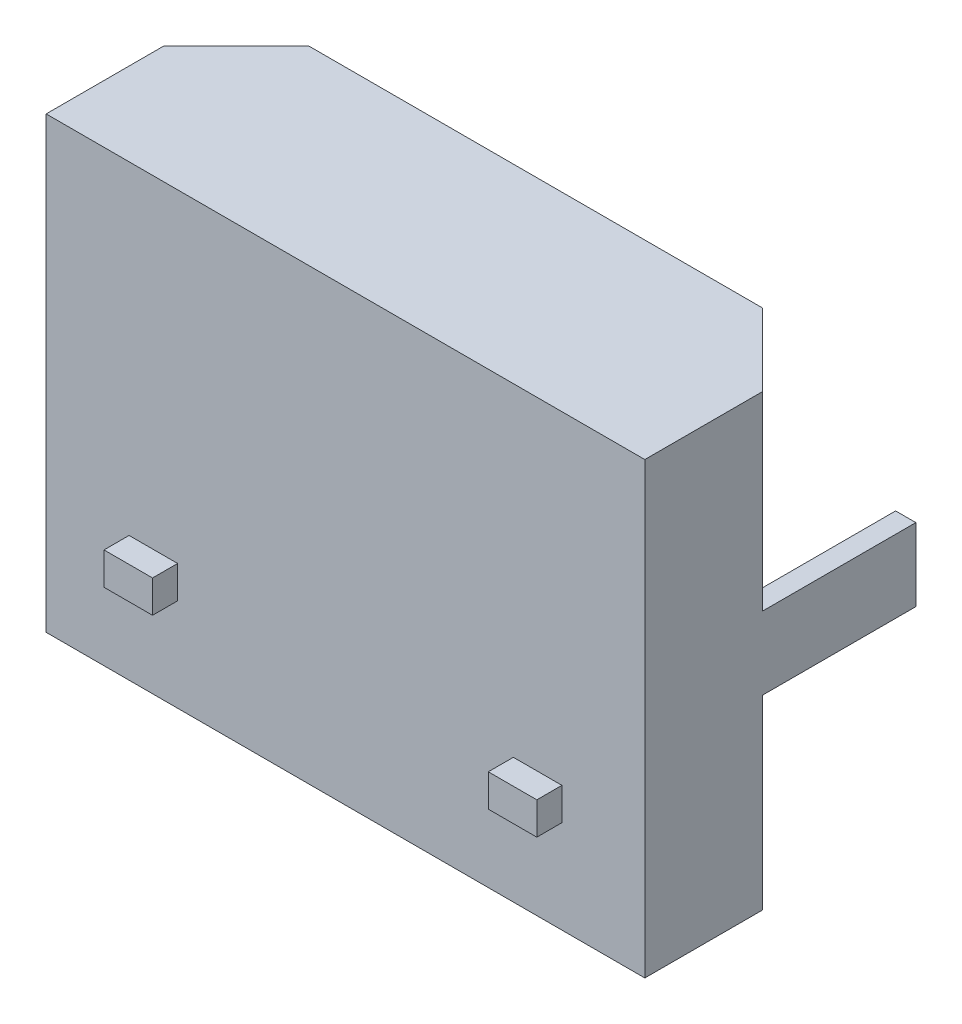
ISO-10303-21;
HEADER;
FILE_DESCRIPTION(('STEP AP214'),'2;1');
FILE_NAME('part.step','',(''),(''),'','','');
FILE_SCHEMA(('AUTOMOTIVE_DESIGN { 1 0 10303 214 1 1 1 1 }'));
ENDSEC;
DATA;
#1=APPLICATION_CONTEXT('core data for automotive mechanical design processes');
#2=APPLICATION_PROTOCOL_DEFINITION('international standard','automotive_design',2000,#1);
#3=PRODUCT_CONTEXT('',#1,'mechanical');
#4=PRODUCT('Part','Part','',(#3));
#5=PRODUCT_RELATED_PRODUCT_CATEGORY('part','',(#4));
#6=PRODUCT_DEFINITION_FORMATION('','',#4);
#7=PRODUCT_DEFINITION_CONTEXT('part definition',#1,'design');
#8=PRODUCT_DEFINITION('design','',#6,#7);
#9=PRODUCT_DEFINITION_SHAPE('','',#8);
#10=(LENGTH_UNIT() NAMED_UNIT(*) SI_UNIT(.MILLI.,.METRE.));
#11=(NAMED_UNIT(*) PLANE_ANGLE_UNIT() SI_UNIT($,.RADIAN.));
#12=(NAMED_UNIT(*) SI_UNIT($,.STERADIAN.) SOLID_ANGLE_UNIT());
#13=UNCERTAINTY_MEASURE_WITH_UNIT(LENGTH_MEASURE(1.E-05),#10,'distance_accuracy_value','');
#14=(GEOMETRIC_REPRESENTATION_CONTEXT(3) GLOBAL_UNCERTAINTY_ASSIGNED_CONTEXT((#13)) GLOBAL_UNIT_ASSIGNED_CONTEXT((#10,
#11,#12)) REPRESENTATION_CONTEXT('',''));
#15=CARTESIAN_POINT('',(0.,0.,0.));
#16=DIRECTION('',(0.,0.,1.));
#17=DIRECTION('',(1.,0.,0.));
#18=AXIS2_PLACEMENT_3D('',#15,#16,#17);
#19=CARTESIAN_POINT('',(0.,2.79999999999999,2.35000000000001));
#20=DIRECTION('',(0.,0.,1.));
#21=DIRECTION('',(-1.,0.,0.));
#22=AXIS2_PLACEMENT_3D('',#19,#20,#21);
#23=PLANE('',#22);
#24=DIRECTION('',(1.,0.,0.));
#25=VECTOR('',#24,1.);
#26=CARTESIAN_POINT('',(-2.675,-1.60000000000001,2.34999999999999));
#27=LINE('',#26,#25);
#28=CARTESIAN_POINT('',(-2.675,-1.60000000000001,2.34999999999999));
#29=VERTEX_POINT('',#28);
#30=CARTESIAN_POINT('',(-2.075,-1.60000000000001,2.34999999999999));
#31=VERTEX_POINT('',#30);
#32=EDGE_CURVE('E248',#29,#31,#27,.T.);
#33=ORIENTED_EDGE('',*,*,#32,.F.);
#34=DIRECTION('',(0.,-1.,0.));
#35=VECTOR('',#34,1.);
#36=CARTESIAN_POINT('',(-2.675,-1.60000000000001,2.34999999999999));
#37=LINE('',#36,#35);
#38=CARTESIAN_POINT('',(-2.675,-1.20000000000001,2.35));
#39=VERTEX_POINT('',#38);
#40=EDGE_CURVE('E245',#39,#29,#37,.T.);
#41=ORIENTED_EDGE('',*,*,#40,.F.);
#42=DIRECTION('',(-1.,0.,0.));
#43=VECTOR('',#42,1.);
#44=CARTESIAN_POINT('',(-2.675,-1.20000000000001,2.35));
#45=LINE('',#44,#43);
#46=CARTESIAN_POINT('',(-2.075,-1.20000000000001,2.35));
#47=VERTEX_POINT('',#46);
#48=EDGE_CURVE('E257',#47,#39,#45,.T.);
#49=ORIENTED_EDGE('',*,*,#48,.F.);
#50=DIRECTION('',(0.,1.,0.));
#51=VECTOR('',#50,1.);
#52=CARTESIAN_POINT('',(-2.075,-1.60000000000001,2.34999999999999));
#53=LINE('',#52,#51);
#54=EDGE_CURVE('E265',#31,#47,#53,.T.);
#55=ORIENTED_EDGE('',*,*,#54,.F.);
#56=EDGE_LOOP('',(#33,#41,#49,#55));
#57=FACE_BOUND('',#56,.T.);
#58=DIRECTION('',(0.,-1.,0.));
#59=VECTOR('',#58,1.);
#60=CARTESIAN_POINT('',(-3.7,2.79999999999999,2.35000000000001));
#61=LINE('',#60,#59);
#62=CARTESIAN_POINT('',(-3.7,2.79999999999999,2.35000000000001));
#63=VERTEX_POINT('',#62);
#64=CARTESIAN_POINT('',(-3.7,-2.75000000000001,2.34999999999999));
#65=VERTEX_POINT('',#64);
#66=EDGE_CURVE('E423',#63,#65,#61,.T.);
#67=ORIENTED_EDGE('',*,*,#66,.T.);
#68=DIRECTION('',(-1.,0.,0.));
#69=VECTOR('',#68,1.);
#70=CARTESIAN_POINT('',(0.,-2.75000000000001,2.34999999999999));
#71=LINE('',#70,#69);
#72=CARTESIAN_POINT('',(3.7,-2.75000000000001,2.34999999999999));
#73=VERTEX_POINT('',#72);
#74=EDGE_CURVE('E388',#73,#65,#71,.T.);
#75=ORIENTED_EDGE('',*,*,#74,.F.);
#76=DIRECTION('',(0.,-1.,0.));
#77=VECTOR('',#76,1.);
#78=CARTESIAN_POINT('',(3.7,2.79999999999999,2.35000000000001));
#79=LINE('',#78,#77);
#80=CARTESIAN_POINT('',(3.7,2.79999999999999,2.35000000000001));
#81=VERTEX_POINT('',#80);
#82=EDGE_CURVE('E425',#81,#73,#79,.T.);
#83=ORIENTED_EDGE('',*,*,#82,.F.);
#84=DIRECTION('',(-1.,0.,0.));
#85=VECTOR('',#84,1.);
#86=CARTESIAN_POINT('',(0.,2.79999999999999,2.35000000000001));
#87=LINE('',#86,#85);
#88=EDGE_CURVE('E406',#81,#63,#87,.T.);
#89=ORIENTED_EDGE('',*,*,#88,.T.);
#90=EDGE_LOOP('',(#67,#75,#83,#89));
#91=FACE_BOUND('',#90,.T.);
#92=DIRECTION('',(1.,0.,0.));
#93=VECTOR('',#92,1.);
#94=CARTESIAN_POINT('',(2.075,-1.60000000000001,2.35));
#95=LINE('',#94,#93);
#96=CARTESIAN_POINT('',(2.075,-1.60000000000001,2.35));
#97=VERTEX_POINT('',#96);
#98=CARTESIAN_POINT('',(2.675,-1.60000000000001,2.35));
#99=VERTEX_POINT('',#98);
#100=EDGE_CURVE('E784',#97,#99,#95,.T.);
#101=ORIENTED_EDGE('',*,*,#100,.F.);
#102=DIRECTION('',(0.,-1.,0.));
#103=VECTOR('',#102,1.);
#104=CARTESIAN_POINT('',(2.075,-1.60000000000001,2.35));
#105=LINE('',#104,#103);
#106=CARTESIAN_POINT('',(2.075,-1.20000000000001,2.35));
#107=VERTEX_POINT('',#106);
#108=EDGE_CURVE('E243',#107,#97,#105,.T.);
#109=ORIENTED_EDGE('',*,*,#108,.F.);
#110=DIRECTION('',(-1.,0.,0.));
#111=VECTOR('',#110,1.);
#112=CARTESIAN_POINT('',(2.075,-1.20000000000001,2.35));
#113=LINE('',#112,#111);
#114=CARTESIAN_POINT('',(2.675,-1.20000000000001,2.35));
#115=VERTEX_POINT('',#114);
#116=EDGE_CURVE('E239',#115,#107,#113,.T.);
#117=ORIENTED_EDGE('',*,*,#116,.F.);
#118=DIRECTION('',(0.,1.,0.));
#119=VECTOR('',#118,1.);
#120=CARTESIAN_POINT('',(2.675,-1.60000000000001,2.35));
#121=LINE('',#120,#119);
#122=EDGE_CURVE('E781',#99,#115,#121,.T.);
#123=ORIENTED_EDGE('',*,*,#122,.F.);
#124=EDGE_LOOP('',(#101,#109,#117,#123));
#125=FACE_BOUND('',#124,.T.);
#126=ADVANCED_FACE('F34',(#57,#91,#125),#23,.T.);
#127=CARTESIAN_POINT('',(0.,2.8,0.));
#128=DIRECTION('',(0.,0.,-1.));
#129=DIRECTION('',(1.,0.,0.));
#130=AXIS2_PLACEMENT_3D('',#127,#128,#129);
#131=PLANE('',#130);
#132=DIRECTION('',(0.,-1.,0.));
#133=VECTOR('',#132,1.);
#134=CARTESIAN_POINT('',(2.80355339059327,2.8,0.));
#135=LINE('',#134,#133);
#136=CARTESIAN_POINT('',(2.80355339059327,2.8,0.));
#137=VERTEX_POINT('',#136);
#138=CARTESIAN_POINT('',(2.80355339059327,-2.75,0.));
#139=VERTEX_POINT('',#138);
#140=EDGE_CURVE('E415',#137,#139,#135,.T.);
#141=ORIENTED_EDGE('',*,*,#140,.T.);
#142=DIRECTION('',(1.,0.,0.));
#143=VECTOR('',#142,1.);
#144=CARTESIAN_POINT('',(0.,-2.75,0.));
#145=LINE('',#144,#143);
#146=CARTESIAN_POINT('',(-2.80355339059327,-2.75,0.));
#147=VERTEX_POINT('',#146);
#148=EDGE_CURVE('E371',#147,#139,#145,.T.);
#149=ORIENTED_EDGE('',*,*,#148,.F.);
#150=DIRECTION('',(0.,-1.,0.));
#151=VECTOR('',#150,1.);
#152=CARTESIAN_POINT('',(-2.80355339059327,2.8,0.));
#153=LINE('',#152,#151);
#154=CARTESIAN_POINT('',(-2.80355339059327,2.8,0.));
#155=VERTEX_POINT('',#154);
#156=EDGE_CURVE('E416',#155,#147,#153,.T.);
#157=ORIENTED_EDGE('',*,*,#156,.F.);
#158=DIRECTION('',(1.,0.,0.));
#159=VECTOR('',#158,1.);
#160=CARTESIAN_POINT('',(0.,2.8,0.));
#161=LINE('',#160,#159);
#162=EDGE_CURVE('E397',#155,#137,#161,.T.);
#163=ORIENTED_EDGE('',*,*,#162,.T.);
#164=EDGE_LOOP('',(#141,#149,#157,#163));
#165=FACE_BOUND('',#164,.T.);
#166=ADVANCED_FACE('F36',(#165),#131,.T.);
#167=CARTESIAN_POINT('',(-1.40177669529664,2.8,-1.40177669529663));
#168=DIRECTION('',(-0.707106781186548,0.,-0.707106781186547));
#169=DIRECTION('',(0.707106781186547,0.,-0.707106781186548));
#170=AXIS2_PLACEMENT_3D('',#167,#168,#169);
#171=PLANE('',#170);
#172=DIRECTION('',(0.707106781186547,0.,-0.707106781186548));
#173=VECTOR('',#172,1.);
#174=CARTESIAN_POINT('',(-1.40177669529664,0.450000000000005,-1.40177669529664));
#175=LINE('',#174,#173);
#176=CARTESIAN_POINT('',(-3.7,0.449999999999997,0.896446609406729));
#177=VERTEX_POINT('',#176);
#178=CARTESIAN_POINT('',(-3.45,0.449999999999998,0.646446609406728));
#179=VERTEX_POINT('',#178);
#180=EDGE_CURVE('E352',#177,#179,#175,.T.);
#181=ORIENTED_EDGE('',*,*,#180,.F.);
#182=DIRECTION('',(0.,-1.,0.));
#183=VECTOR('',#182,1.);
#184=CARTESIAN_POINT('',(-3.7,2.8,0.896446609406737));
#185=LINE('',#184,#183);
#186=CARTESIAN_POINT('',(-3.7,2.8,0.896446609406737));
#187=VERTEX_POINT('',#186);
#188=EDGE_CURVE('E419',#187,#177,#185,.T.);
#189=ORIENTED_EDGE('',*,*,#188,.F.);
#190=DIRECTION('',(0.707106781186547,0.,-0.707106781186548));
#191=VECTOR('',#190,1.);
#192=CARTESIAN_POINT('',(-1.40177669529664,2.8,-1.40177669529663));
#193=LINE('',#192,#191);
#194=EDGE_CURVE('E412',#187,#155,#193,.T.);
#195=ORIENTED_EDGE('',*,*,#194,.T.);
#196=ORIENTED_EDGE('',*,*,#156,.T.);
#197=DIRECTION('',(0.707106781186547,0.,-0.707106781186548));
#198=VECTOR('',#197,1.);
#199=CARTESIAN_POINT('',(-1.40177669529664,-2.75,-1.40177669529665));
#200=LINE('',#199,#198);
#201=CARTESIAN_POINT('',(-3.7,-2.75,0.896446609406717));
#202=VERTEX_POINT('',#201);
#203=EDGE_CURVE('E394',#202,#147,#200,.T.);
#204=ORIENTED_EDGE('',*,*,#203,.F.);
#205=CARTESIAN_POINT('',(-3.7,-0.450000000000003,0.896446609406726));
#206=VERTEX_POINT('',#205);
#207=EDGE_CURVE('E422',#206,#202,#185,.T.);
#208=ORIENTED_EDGE('',*,*,#207,.F.);
#209=DIRECTION('',(-0.707106781186547,0.,0.707106781186548));
#210=VECTOR('',#209,1.);
#211=CARTESIAN_POINT('',(-1.40177669529664,-0.449999999999995,-1.40177669529664));
#212=LINE('',#211,#210);
#213=CARTESIAN_POINT('',(-3.45,-0.450000000000002,0.646446609406725));
#214=VERTEX_POINT('',#213);
#215=EDGE_CURVE('E338',#214,#206,#212,.T.);
#216=ORIENTED_EDGE('',*,*,#215,.F.);
#217=DIRECTION('',(0.,-1.,0.));
#218=VECTOR('',#217,1.);
#219=CARTESIAN_POINT('',(-3.45,2.8,0.646446609406737));
#220=LINE('',#219,#218);
#221=EDGE_CURVE('E349',#179,#214,#220,.T.);
#222=ORIENTED_EDGE('',*,*,#221,.F.);
#223=EDGE_LOOP('',(#181,#189,#195,#196,#204,#208,#216,#222));
#224=FACE_BOUND('',#223,.T.);
#225=ADVANCED_FACE('F471',(#224),#171,.T.);
#226=CARTESIAN_POINT('',(-3.7,2.8,0.));
#227=DIRECTION('',(-1.,0.,0.));
#228=DIRECTION('',(0.,0.,-1.));
#229=AXIS2_PLACEMENT_3D('',#226,#227,#228);
#230=PLANE('',#229);
#231=DIRECTION('',(0.,0.,-1.));
#232=VECTOR('',#231,1.);
#233=CARTESIAN_POINT('',(-3.7,-2.75,0.));
#234=LINE('',#233,#232);
#235=EDGE_CURVE('E391',#65,#202,#234,.T.);
#236=ORIENTED_EDGE('',*,*,#235,.F.);
#237=ORIENTED_EDGE('',*,*,#66,.F.);
#238=DIRECTION('',(0.,0.,-1.));
#239=VECTOR('',#238,1.);
#240=CARTESIAN_POINT('',(-3.7,2.8,0.));
#241=LINE('',#240,#239);
#242=EDGE_CURVE('E409',#63,#187,#241,.T.);
#243=ORIENTED_EDGE('',*,*,#242,.T.);
#244=ORIENTED_EDGE('',*,*,#188,.T.);
#245=DIRECTION('',(0.,0.,1.));
#246=VECTOR('',#245,1.);
#247=CARTESIAN_POINT('',(-3.7,0.450000000000003,-0.999999999999999));
#248=LINE('',#247,#246);
#249=CARTESIAN_POINT('',(-3.7,0.450000000000003,-0.999999999999999));
#250=VERTEX_POINT('',#249);
#251=EDGE_CURVE('E335',#250,#177,#248,.T.);
#252=ORIENTED_EDGE('',*,*,#251,.F.);
#253=DIRECTION('',(0.,-1.,0.));
#254=VECTOR('',#253,1.);
#255=CARTESIAN_POINT('',(-3.7,0.450000000000003,-0.999999999999999));
#256=LINE('',#255,#254);
#257=CARTESIAN_POINT('',(-3.7,-0.449999999999997,-1.));
#258=VERTEX_POINT('',#257);
#259=EDGE_CURVE('E312',#250,#258,#256,.T.);
#260=ORIENTED_EDGE('',*,*,#259,.T.);
#261=DIRECTION('',(0.,0.,1.));
#262=VECTOR('',#261,1.);
#263=CARTESIAN_POINT('',(-3.7,-0.449999999999997,-1.));
#264=LINE('',#263,#262);
#265=EDGE_CURVE('E334',#258,#206,#264,.T.);
#266=ORIENTED_EDGE('',*,*,#265,.T.);
#267=ORIENTED_EDGE('',*,*,#207,.T.);
#268=EDGE_LOOP('',(#236,#237,#243,#244,#252,#260,#266,#267));
#269=FACE_BOUND('',#268,.T.);
#270=ADVANCED_FACE('F468',(#269),#230,.T.);
#271=CARTESIAN_POINT('',(3.7,2.8,0.));
#272=DIRECTION('',(1.,0.,0.));
#273=DIRECTION('',(0.,0.,1.));
#274=AXIS2_PLACEMENT_3D('',#271,#272,#273);
#275=PLANE('',#274);
#276=ORIENTED_EDGE('',*,*,#82,.T.);
#277=DIRECTION('',(0.,0.,1.));
#278=VECTOR('',#277,1.);
#279=CARTESIAN_POINT('',(3.7,-2.75,0.));
#280=LINE('',#279,#278);
#281=CARTESIAN_POINT('',(3.7,-2.75,0.896446609406717));
#282=VERTEX_POINT('',#281);
#283=EDGE_CURVE('E385',#282,#73,#280,.T.);
#284=ORIENTED_EDGE('',*,*,#283,.F.);
#285=DIRECTION('',(0.,-1.,0.));
#286=VECTOR('',#285,1.);
#287=CARTESIAN_POINT('',(3.7,2.8,0.896446609406737));
#288=LINE('',#287,#286);
#289=CARTESIAN_POINT('',(3.7,-0.450000000000003,0.896446609406726));
#290=VERTEX_POINT('',#289);
#291=EDGE_CURVE('E429',#290,#282,#288,.T.);
#292=ORIENTED_EDGE('',*,*,#291,.F.);
#293=DIRECTION('',(0.,0.,1.));
#294=VECTOR('',#293,1.);
#295=CARTESIAN_POINT('',(3.7,-0.449999999999997,-1.));
#296=LINE('',#295,#294);
#297=CARTESIAN_POINT('',(3.7,-0.449999999999997,-1.));
#298=VERTEX_POINT('',#297);
#299=EDGE_CURVE('E368',#298,#290,#296,.T.);
#300=ORIENTED_EDGE('',*,*,#299,.F.);
#301=DIRECTION('',(0.,1.,0.));
#302=VECTOR('',#301,1.);
#303=CARTESIAN_POINT('',(3.7,0.450000000000004,-0.999999999999997));
#304=LINE('',#303,#302);
#305=CARTESIAN_POINT('',(3.7,0.450000000000004,-0.999999999999997));
#306=VERTEX_POINT('',#305);
#307=EDGE_CURVE('E355',#298,#306,#304,.T.);
#308=ORIENTED_EDGE('',*,*,#307,.T.);
#309=DIRECTION('',(0.,0.,1.));
#310=VECTOR('',#309,1.);
#311=CARTESIAN_POINT('',(3.7,0.450000000000004,-0.999999999999997));
#312=LINE('',#311,#310);
#313=CARTESIAN_POINT('',(3.7,0.449999999999998,0.896446609406728));
#314=VERTEX_POINT('',#313);
#315=EDGE_CURVE('E367',#306,#314,#312,.T.);
#316=ORIENTED_EDGE('',*,*,#315,.T.);
#317=CARTESIAN_POINT('',(3.7,2.8,0.896446609406737));
#318=VERTEX_POINT('',#317);
#319=EDGE_CURVE('E427',#318,#314,#288,.T.);
#320=ORIENTED_EDGE('',*,*,#319,.F.);
#321=DIRECTION('',(0.,0.,1.));
#322=VECTOR('',#321,1.);
#323=CARTESIAN_POINT('',(3.7,2.8,0.));
#324=LINE('',#323,#322);
#325=EDGE_CURVE('E403',#318,#81,#324,.T.);
#326=ORIENTED_EDGE('',*,*,#325,.T.);
#327=EDGE_LOOP('',(#276,#284,#292,#300,#308,#316,#320,#326));
#328=FACE_BOUND('',#327,.T.);
#329=ADVANCED_FACE('F445',(#328),#275,.T.);
#330=CARTESIAN_POINT('',(1.40177669529664,2.8,-1.40177669529663));
#331=DIRECTION('',(0.707106781186547,0.,-0.707106781186548));
#332=DIRECTION('',(0.707106781186548,0.,0.707106781186547));
#333=AXIS2_PLACEMENT_3D('',#330,#331,#332);
#334=PLANE('',#333);
#335=DIRECTION('',(-0.707106781186548,0.,-0.707106781186547));
#336=VECTOR('',#335,1.);
#337=CARTESIAN_POINT('',(1.40177669529663,-0.449999999999989,-1.40177669529664));
#338=LINE('',#337,#336);
#339=CARTESIAN_POINT('',(3.45,-0.450000000000002,0.646446609406725));
#340=VERTEX_POINT('',#339);
#341=EDGE_CURVE('E11',#290,#340,#338,.T.);
#342=ORIENTED_EDGE('',*,*,#341,.F.);
#343=ORIENTED_EDGE('',*,*,#291,.T.);
#344=DIRECTION('',(0.707106781186548,0.,0.707106781186547));
#345=VECTOR('',#344,1.);
#346=CARTESIAN_POINT('',(1.40177669529664,-2.75,-1.40177669529665));
#347=LINE('',#346,#345);
#348=EDGE_CURVE('E382',#139,#282,#347,.T.);
#349=ORIENTED_EDGE('',*,*,#348,.F.);
#350=ORIENTED_EDGE('',*,*,#140,.F.);
#351=DIRECTION('',(0.707106781186548,0.,0.707106781186547));
#352=VECTOR('',#351,1.);
#353=CARTESIAN_POINT('',(1.40177669529664,2.8,-1.40177669529663));
#354=LINE('',#353,#352);
#355=EDGE_CURVE('E400',#137,#318,#354,.T.);
#356=ORIENTED_EDGE('',*,*,#355,.T.);
#357=ORIENTED_EDGE('',*,*,#319,.T.);
#358=DIRECTION('',(0.707106781186548,0.,0.707106781186547));
#359=VECTOR('',#358,1.);
#360=CARTESIAN_POINT('',(1.40177669529664,0.449999999999999,-1.40177669529663));
#361=LINE('',#360,#359);
#362=CARTESIAN_POINT('',(3.45,0.449999999999998,0.646446609406728));
#363=VERTEX_POINT('',#362);
#364=EDGE_CURVE('E418',#363,#314,#361,.T.);
#365=ORIENTED_EDGE('',*,*,#364,.F.);
#366=DIRECTION('',(0.,1.,0.));
#367=VECTOR('',#366,1.);
#368=CARTESIAN_POINT('',(3.45,2.8,0.646446609406736));
#369=LINE('',#368,#367);
#370=EDGE_CURVE('E42',#340,#363,#369,.T.);
#371=ORIENTED_EDGE('',*,*,#370,.F.);
#372=EDGE_LOOP('',(#342,#343,#349,#350,#356,#357,#365,#371));
#373=FACE_BOUND('',#372,.T.);
#374=ADVANCED_FACE('F450',(#373),#334,.T.);
#375=CARTESIAN_POINT('',(0.,2.8,0.));
#376=DIRECTION('',(0.,-1.,0.));
#377=DIRECTION('',(1.,0.,0.));
#378=AXIS2_PLACEMENT_3D('',#375,#376,#377);
#379=PLANE('',#378);
#380=ORIENTED_EDGE('',*,*,#162,.F.);
#381=ORIENTED_EDGE('',*,*,#194,.F.);
#382=ORIENTED_EDGE('',*,*,#242,.F.);
#383=ORIENTED_EDGE('',*,*,#88,.F.);
#384=ORIENTED_EDGE('',*,*,#325,.F.);
#385=ORIENTED_EDGE('',*,*,#355,.F.);
#386=EDGE_LOOP('',(#380,#381,#382,#383,#384,#385));
#387=FACE_BOUND('',#386,.T.);
#388=ADVANCED_FACE('F463',(#387),#379,.F.);
#389=CARTESIAN_POINT('',(0.,-2.75,0.));
#390=DIRECTION('',(0.,-1.,0.));
#391=DIRECTION('',(1.,0.,0.));
#392=AXIS2_PLACEMENT_3D('',#389,#390,#391);
#393=PLANE('',#392);
#394=DIRECTION('',(0.707106781186547,0.,-0.707106781186548));
#395=VECTOR('',#394,1.);
#396=CARTESIAN_POINT('',(-1.225,-2.75,-1.22500000000001));
#397=LINE('',#396,#395);
#398=CARTESIAN_POINT('',(-3.45,-2.75,0.999999999999991));
#399=VERTEX_POINT('',#398);
#400=CARTESIAN_POINT('',(-2.7,-2.75,0.24999999999999));
#401=VERTEX_POINT('',#400);
#402=EDGE_CURVE('E276',#399,#401,#397,.T.);
#403=ORIENTED_EDGE('',*,*,#402,.F.);
#404=DIRECTION('',(0.,0.,1.));
#405=VECTOR('',#404,1.);
#406=CARTESIAN_POINT('',(-3.45,-2.75,0.));
#407=LINE('',#406,#405);
#408=CARTESIAN_POINT('',(-3.45,-2.75000000000001,2.09999999999999));
#409=VERTEX_POINT('',#408);
#410=EDGE_CURVE('E290',#399,#409,#407,.T.);
#411=ORIENTED_EDGE('',*,*,#410,.T.);
#412=DIRECTION('',(1.,0.,0.));
#413=VECTOR('',#412,1.);
#414=CARTESIAN_POINT('',(0.,-2.75000000000001,2.09999999999999));
#415=LINE('',#414,#413);
#416=CARTESIAN_POINT('',(3.45,-2.75000000000001,2.09999999999999));
#417=VERTEX_POINT('',#416);
#418=EDGE_CURVE('E287',#409,#417,#415,.T.);
#419=ORIENTED_EDGE('',*,*,#418,.T.);
#420=DIRECTION('',(0.,0.,1.));
#421=VECTOR('',#420,1.);
#422=CARTESIAN_POINT('',(3.45,-2.75,0.));
#423=LINE('',#422,#421);
#424=CARTESIAN_POINT('',(3.45,-2.75,0.999999999999991));
#425=VERTEX_POINT('',#424);
#426=EDGE_CURVE('E284',#425,#417,#423,.T.);
#427=ORIENTED_EDGE('',*,*,#426,.F.);
#428=DIRECTION('',(0.707106781186548,0.,0.707106781186547));
#429=VECTOR('',#428,1.);
#430=CARTESIAN_POINT('',(1.225,-2.75,-1.22500000000001));
#431=LINE('',#430,#429);
#432=CARTESIAN_POINT('',(2.7,-2.75,0.249999999999991));
#433=VERTEX_POINT('',#432);
#434=EDGE_CURVE('E281',#433,#425,#431,.T.);
#435=ORIENTED_EDGE('',*,*,#434,.F.);
#436=DIRECTION('',(1.,0.,0.));
#437=VECTOR('',#436,1.);
#438=CARTESIAN_POINT('',(0.,-2.75,0.24999999999999));
#439=LINE('',#438,#437);
#440=EDGE_CURVE('E278',#401,#433,#439,.T.);
#441=ORIENTED_EDGE('',*,*,#440,.F.);
#442=EDGE_LOOP('',(#403,#411,#419,#427,#435,#441));
#443=FACE_BOUND('',#442,.T.);
#444=ORIENTED_EDGE('',*,*,#148,.T.);
#445=ORIENTED_EDGE('',*,*,#348,.T.);
#446=ORIENTED_EDGE('',*,*,#283,.T.);
#447=ORIENTED_EDGE('',*,*,#74,.T.);
#448=ORIENTED_EDGE('',*,*,#235,.T.);
#449=ORIENTED_EDGE('',*,*,#203,.T.);
#450=EDGE_LOOP('',(#444,#445,#446,#447,#448,#449));
#451=FACE_BOUND('',#450,.T.);
#452=ADVANCED_FACE('F453',(#443,#451),#393,.T.);
#453=CARTESIAN_POINT('',(3.7,-0.449999999999997,-1.));
#454=DIRECTION('',(0.,-1.,0.));
#455=DIRECTION('',(1.,0.,0.));
#456=AXIS2_PLACEMENT_3D('',#453,#454,#455);
#457=PLANE('',#456);
#458=ORIENTED_EDGE('',*,*,#299,.T.);
#459=ORIENTED_EDGE('',*,*,#341,.T.);
#460=DIRECTION('',(0.,0.,1.));
#461=VECTOR('',#460,1.);
#462=CARTESIAN_POINT('',(3.45,-0.449999999999997,-1.));
#463=LINE('',#462,#461);
#464=CARTESIAN_POINT('',(3.45,-0.449999999999997,-1.));
#465=VERTEX_POINT('',#464);
#466=EDGE_CURVE('E372',#465,#340,#463,.T.);
#467=ORIENTED_EDGE('',*,*,#466,.F.);
#468=DIRECTION('',(1.,0.,0.));
#469=VECTOR('',#468,1.);
#470=CARTESIAN_POINT('',(3.7,-0.449999999999997,-1.));
#471=LINE('',#470,#469);
#472=EDGE_CURVE('E364',#465,#298,#471,.T.);
#473=ORIENTED_EDGE('',*,*,#472,.T.);
#474=EDGE_LOOP('',(#458,#459,#467,#473));
#475=FACE_BOUND('',#474,.T.);
#476=ADVANCED_FACE('F449',(#475),#457,.T.);
#477=CARTESIAN_POINT('',(3.45,-0.449999999999997,-1.));
#478=DIRECTION('',(-1.,0.,0.));
#479=DIRECTION('',(0.,0.,-1.));
#480=AXIS2_PLACEMENT_3D('',#477,#478,#479);
#481=PLANE('',#480);
#482=ORIENTED_EDGE('',*,*,#466,.T.);
#483=ORIENTED_EDGE('',*,*,#370,.T.);
#484=DIRECTION('',(0.,0.,1.));
#485=VECTOR('',#484,1.);
#486=CARTESIAN_POINT('',(3.45,0.450000000000004,-0.999999999999998));
#487=LINE('',#486,#485);
#488=CARTESIAN_POINT('',(3.45,0.450000000000004,-0.999999999999998));
#489=VERTEX_POINT('',#488);
#490=EDGE_CURVE('E375',#489,#363,#487,.T.);
#491=ORIENTED_EDGE('',*,*,#490,.F.);
#492=DIRECTION('',(0.,-1.,0.));
#493=VECTOR('',#492,1.);
#494=CARTESIAN_POINT('',(3.45,-0.449999999999997,-1.));
#495=LINE('',#494,#493);
#496=EDGE_CURVE('E361',#489,#465,#495,.T.);
#497=ORIENTED_EDGE('',*,*,#496,.T.);
#498=EDGE_LOOP('',(#482,#483,#491,#497));
#499=FACE_BOUND('',#498,.T.);
#500=ADVANCED_FACE('F434',(#499),#481,.T.);
#501=CARTESIAN_POINT('',(3.45,0.450000000000004,-0.999999999999998));
#502=DIRECTION('',(0.,1.,0.));
#503=DIRECTION('',(-1.,0.,0.));
#504=AXIS2_PLACEMENT_3D('',#501,#502,#503);
#505=PLANE('',#504);
#506=ORIENTED_EDGE('',*,*,#490,.T.);
#507=ORIENTED_EDGE('',*,*,#364,.T.);
#508=ORIENTED_EDGE('',*,*,#315,.F.);
#509=DIRECTION('',(-1.,0.,0.));
#510=VECTOR('',#509,1.);
#511=CARTESIAN_POINT('',(3.45,0.450000000000004,-0.999999999999998));
#512=LINE('',#511,#510);
#513=EDGE_CURVE('E358',#306,#489,#512,.T.);
#514=ORIENTED_EDGE('',*,*,#513,.T.);
#515=EDGE_LOOP('',(#506,#507,#508,#514));
#516=FACE_BOUND('',#515,.T.);
#517=ADVANCED_FACE('F438',(#516),#505,.T.);
#518=CARTESIAN_POINT('',(0.,0.,-1.00000000000001));
#519=DIRECTION('',(0.,0.,-1.));
#520=DIRECTION('',(1.,0.,0.));
#521=AXIS2_PLACEMENT_3D('',#518,#519,#520);
#522=PLANE('',#521);
#523=ORIENTED_EDGE('',*,*,#307,.F.);
#524=ORIENTED_EDGE('',*,*,#472,.F.);
#525=ORIENTED_EDGE('',*,*,#496,.F.);
#526=ORIENTED_EDGE('',*,*,#513,.F.);
#527=EDGE_LOOP('',(#523,#524,#525,#526));
#528=FACE_BOUND('',#527,.T.);
#529=ADVANCED_FACE('F442',(#528),#522,.T.);
#530=CARTESIAN_POINT('',(-3.45,0.450000000000003,-0.999999999999999));
#531=DIRECTION('',(0.,1.,0.));
#532=DIRECTION('',(-1.,0.,0.));
#533=AXIS2_PLACEMENT_3D('',#530,#531,#532);
#534=PLANE('',#533);
#535=ORIENTED_EDGE('',*,*,#251,.T.);
#536=ORIENTED_EDGE('',*,*,#180,.T.);
#537=DIRECTION('',(0.,0.,1.));
#538=VECTOR('',#537,1.);
#539=CARTESIAN_POINT('',(-3.45,0.450000000000003,-0.999999999999999));
#540=LINE('',#539,#538);
#541=CARTESIAN_POINT('',(-3.45,0.450000000000003,-0.999999999999999));
#542=VERTEX_POINT('',#541);
#543=EDGE_CURVE('E339',#542,#179,#540,.T.);
#544=ORIENTED_EDGE('',*,*,#543,.F.);
#545=DIRECTION('',(-1.,0.,0.));
#546=VECTOR('',#545,1.);
#547=CARTESIAN_POINT('',(-3.45,0.450000000000003,-0.999999999999999));
#548=LINE('',#547,#546);
#549=EDGE_CURVE('E331',#542,#250,#548,.T.);
#550=ORIENTED_EDGE('',*,*,#549,.T.);
#551=EDGE_LOOP('',(#535,#536,#544,#550));
#552=FACE_BOUND('',#551,.T.);
#553=ADVANCED_FACE('F506',(#552),#534,.T.);
#554=CARTESIAN_POINT('',(-3.45,-0.449999999999997,-1.));
#555=DIRECTION('',(1.,0.,0.));
#556=DIRECTION('',(0.,0.,1.));
#557=AXIS2_PLACEMENT_3D('',#554,#555,#556);
#558=PLANE('',#557);
#559=ORIENTED_EDGE('',*,*,#543,.T.);
#560=ORIENTED_EDGE('',*,*,#221,.T.);
#561=DIRECTION('',(0.,0.,1.));
#562=VECTOR('',#561,1.);
#563=CARTESIAN_POINT('',(-3.45,-0.449999999999997,-1.));
#564=LINE('',#563,#562);
#565=CARTESIAN_POINT('',(-3.45,-0.449999999999997,-1.));
#566=VERTEX_POINT('',#565);
#567=EDGE_CURVE('E342',#566,#214,#564,.T.);
#568=ORIENTED_EDGE('',*,*,#567,.F.);
#569=DIRECTION('',(0.,1.,0.));
#570=VECTOR('',#569,1.);
#571=CARTESIAN_POINT('',(-3.45,-0.449999999999997,-1.));
#572=LINE('',#571,#570);
#573=EDGE_CURVE('E328',#566,#542,#572,.T.);
#574=ORIENTED_EDGE('',*,*,#573,.T.);
#575=EDGE_LOOP('',(#559,#560,#568,#574));
#576=FACE_BOUND('',#575,.T.);
#577=ADVANCED_FACE('F511',(#576),#558,.T.);
#578=CARTESIAN_POINT('',(-3.7,-0.449999999999997,-1.));
#579=DIRECTION('',(0.,-1.,0.));
#580=DIRECTION('',(1.,0.,0.));
#581=AXIS2_PLACEMENT_3D('',#578,#579,#580);
#582=PLANE('',#581);
#583=ORIENTED_EDGE('',*,*,#567,.T.);
#584=ORIENTED_EDGE('',*,*,#215,.T.);
#585=ORIENTED_EDGE('',*,*,#265,.F.);
#586=DIRECTION('',(1.,0.,0.));
#587=VECTOR('',#586,1.);
#588=CARTESIAN_POINT('',(-3.7,-0.449999999999997,-1.));
#589=LINE('',#588,#587);
#590=EDGE_CURVE('E325',#258,#566,#589,.T.);
#591=ORIENTED_EDGE('',*,*,#590,.T.);
#592=EDGE_LOOP('',(#583,#584,#585,#591));
#593=FACE_BOUND('',#592,.T.);
#594=ADVANCED_FACE('F507',(#593),#582,.T.);
#595=CARTESIAN_POINT('',(0.,0.,-0.999999999999994));
#596=DIRECTION('',(0.,0.,1.));
#597=DIRECTION('',(-1.,0.,0.));
#598=AXIS2_PLACEMENT_3D('',#595,#596,#597);
#599=PLANE('',#598);
#600=ORIENTED_EDGE('',*,*,#259,.F.);
#601=ORIENTED_EDGE('',*,*,#549,.F.);
#602=ORIENTED_EDGE('',*,*,#573,.F.);
#603=ORIENTED_EDGE('',*,*,#590,.F.);
#604=EDGE_LOOP('',(#600,#601,#602,#603));
#605=FACE_BOUND('',#604,.T.);
#606=ADVANCED_FACE('F510',(#605),#599,.F.);
#607=CARTESIAN_POINT('',(-1.225,0.750000000000004,-1.225));
#608=DIRECTION('',(-0.707106781186548,0.,-0.707106781186547));
#609=DIRECTION('',(0.707106781186547,0.,-0.707106781186548));
#610=AXIS2_PLACEMENT_3D('',#607,#608,#609);
#611=PLANE('',#610);
#612=DIRECTION('',(0.,-1.,0.));
#613=VECTOR('',#612,1.);
#614=CARTESIAN_POINT('',(-2.7,0.749999999999999,0.250000000000003));
#615=LINE('',#614,#613);
#616=CARTESIAN_POINT('',(-2.7,0.749999999999999,0.250000000000003));
#617=VERTEX_POINT('',#616);
#618=EDGE_CURVE('E309',#617,#401,#615,.T.);
#619=ORIENTED_EDGE('',*,*,#618,.F.);
#620=DIRECTION('',(0.707106781186547,0.,-0.707106781186548));
#621=VECTOR('',#620,1.);
#622=CARTESIAN_POINT('',(-1.225,0.750000000000004,-1.225));
#623=LINE('',#622,#621);
#624=CARTESIAN_POINT('',(-3.45,0.749999999999997,1.));
#625=VERTEX_POINT('',#624);
#626=EDGE_CURVE('E293',#625,#617,#623,.T.);
#627=ORIENTED_EDGE('',*,*,#626,.F.);
#628=DIRECTION('',(0.,-1.,0.));
#629=VECTOR('',#628,1.);
#630=CARTESIAN_POINT('',(-3.45,0.749999999999997,1.));
#631=LINE('',#630,#629);
#632=EDGE_CURVE('E310',#625,#399,#631,.T.);
#633=ORIENTED_EDGE('',*,*,#632,.T.);
#634=ORIENTED_EDGE('',*,*,#402,.T.);
#635=EDGE_LOOP('',(#619,#627,#633,#634));
#636=FACE_BOUND('',#635,.T.);
#637=ADVANCED_FACE('F521',(#636),#611,.F.);
#638=CARTESIAN_POINT('',(-3.45,0.75,0.));
#639=DIRECTION('',(1.,0.,0.));
#640=DIRECTION('',(0.,0.,1.));
#641=AXIS2_PLACEMENT_3D('',#638,#639,#640);
#642=PLANE('',#641);
#643=ORIENTED_EDGE('',*,*,#632,.F.);
#644=DIRECTION('',(0.,0.,1.));
#645=VECTOR('',#644,1.);
#646=CARTESIAN_POINT('',(-3.45,0.75,0.));
#647=LINE('',#646,#645);
#648=CARTESIAN_POINT('',(-3.45,0.749999999999993,2.1));
#649=VERTEX_POINT('',#648);
#650=EDGE_CURVE('E307',#625,#649,#647,.T.);
#651=ORIENTED_EDGE('',*,*,#650,.T.);
#652=DIRECTION('',(0.,-1.,0.));
#653=VECTOR('',#652,1.);
#654=CARTESIAN_POINT('',(-3.45,0.749999999999993,2.1));
#655=LINE('',#654,#653);
#656=EDGE_CURVE('E313',#649,#409,#655,.T.);
#657=ORIENTED_EDGE('',*,*,#656,.T.);
#658=ORIENTED_EDGE('',*,*,#410,.F.);
#659=EDGE_LOOP('',(#643,#651,#657,#658));
#660=FACE_BOUND('',#659,.T.);
#661=ADVANCED_FACE('F525',(#660),#642,.T.);
#662=CARTESIAN_POINT('',(0.,0.749999999999993,2.1));
#663=DIRECTION('',(0.,0.,-1.));
#664=DIRECTION('',(0.,1.,0.));
#665=AXIS2_PLACEMENT_3D('',#662,#663,#664);
#666=PLANE('',#665);
#667=ORIENTED_EDGE('',*,*,#656,.F.);
#668=DIRECTION('',(1.,0.,0.));
#669=VECTOR('',#668,1.);
#670=CARTESIAN_POINT('',(0.,0.749999999999993,2.1));
#671=LINE('',#670,#669);
#672=CARTESIAN_POINT('',(3.45,0.749999999999993,2.1));
#673=VERTEX_POINT('',#672);
#674=EDGE_CURVE('E305',#649,#673,#671,.T.);
#675=ORIENTED_EDGE('',*,*,#674,.T.);
#676=DIRECTION('',(0.,-1.,0.));
#677=VECTOR('',#676,1.);
#678=CARTESIAN_POINT('',(3.45,0.749999999999993,2.1));
#679=LINE('',#678,#677);
#680=EDGE_CURVE('E315',#673,#417,#679,.T.);
#681=ORIENTED_EDGE('',*,*,#680,.T.);
#682=ORIENTED_EDGE('',*,*,#418,.F.);
#683=EDGE_LOOP('',(#667,#675,#681,#682));
#684=FACE_BOUND('',#683,.T.);
#685=ADVANCED_FACE('F539',(#684),#666,.T.);
#686=CARTESIAN_POINT('',(3.45,0.75,0.));
#687=DIRECTION('',(1.,0.,0.));
#688=DIRECTION('',(0.,1.,0.));
#689=AXIS2_PLACEMENT_3D('',#686,#687,#688);
#690=PLANE('',#689);
#691=ORIENTED_EDGE('',*,*,#680,.F.);
#692=DIRECTION('',(0.,0.,1.));
#693=VECTOR('',#692,1.);
#694=CARTESIAN_POINT('',(3.45,0.75,0.));
#695=LINE('',#694,#693);
#696=CARTESIAN_POINT('',(3.45,0.749999999999997,1.));
#697=VERTEX_POINT('',#696);
#698=EDGE_CURVE('E302',#697,#673,#695,.T.);
#699=ORIENTED_EDGE('',*,*,#698,.F.);
#700=DIRECTION('',(0.,-1.,0.));
#701=VECTOR('',#700,1.);
#702=CARTESIAN_POINT('',(3.45,0.749999999999997,1.));
#703=LINE('',#702,#701);
#704=EDGE_CURVE('E317',#697,#425,#703,.T.);
#705=ORIENTED_EDGE('',*,*,#704,.T.);
#706=ORIENTED_EDGE('',*,*,#426,.T.);
#707=EDGE_LOOP('',(#691,#699,#705,#706));
#708=FACE_BOUND('',#707,.T.);
#709=ADVANCED_FACE('F535',(#708),#690,.F.);
#710=CARTESIAN_POINT('',(1.225,0.750000000000004,-1.225));
#711=DIRECTION('',(0.707106781186547,0.,-0.707106781186548));
#712=DIRECTION('',(0.707106781186548,0.,0.707106781186547));
#713=AXIS2_PLACEMENT_3D('',#710,#711,#712);
#714=PLANE('',#713);
#715=ORIENTED_EDGE('',*,*,#704,.F.);
#716=DIRECTION('',(0.707106781186548,0.,0.707106781186547));
#717=VECTOR('',#716,1.);
#718=CARTESIAN_POINT('',(1.225,0.750000000000004,-1.225));
#719=LINE('',#718,#717);
#720=CARTESIAN_POINT('',(2.7,0.749999999999999,0.250000000000003));
#721=VERTEX_POINT('',#720);
#722=EDGE_CURVE('E299',#721,#697,#719,.T.);
#723=ORIENTED_EDGE('',*,*,#722,.F.);
#724=DIRECTION('',(0.,-1.,0.));
#725=VECTOR('',#724,1.);
#726=CARTESIAN_POINT('',(2.7,0.749999999999999,0.250000000000003));
#727=LINE('',#726,#725);
#728=EDGE_CURVE('E319',#721,#433,#727,.T.);
#729=ORIENTED_EDGE('',*,*,#728,.T.);
#730=ORIENTED_EDGE('',*,*,#434,.T.);
#731=EDGE_LOOP('',(#715,#723,#729,#730));
#732=FACE_BOUND('',#731,.T.);
#733=ADVANCED_FACE('F531',(#732),#714,.F.);
#734=CARTESIAN_POINT('',(0.,0.749999999999999,0.250000000000003));
#735=DIRECTION('',(0.,0.,-1.));
#736=DIRECTION('',(0.,1.,0.));
#737=AXIS2_PLACEMENT_3D('',#734,#735,#736);
#738=PLANE('',#737);
#739=ORIENTED_EDGE('',*,*,#728,.F.);
#740=DIRECTION('',(1.,0.,0.));
#741=VECTOR('',#740,1.);
#742=CARTESIAN_POINT('',(0.,0.749999999999999,0.250000000000003));
#743=LINE('',#742,#741);
#744=EDGE_CURVE('E296',#617,#721,#743,.T.);
#745=ORIENTED_EDGE('',*,*,#744,.F.);
#746=ORIENTED_EDGE('',*,*,#618,.T.);
#747=ORIENTED_EDGE('',*,*,#440,.T.);
#748=EDGE_LOOP('',(#739,#745,#746,#747));
#749=FACE_BOUND('',#748,.T.);
#750=ADVANCED_FACE('F527',(#749),#738,.F.);
#751=CARTESIAN_POINT('',(0.,0.75,0.));
#752=DIRECTION('',(0.,-1.,0.));
#753=DIRECTION('',(1.,0.,0.));
#754=AXIS2_PLACEMENT_3D('',#751,#752,#753);
#755=PLANE('',#754);
#756=ORIENTED_EDGE('',*,*,#626,.T.);
#757=ORIENTED_EDGE('',*,*,#744,.T.);
#758=ORIENTED_EDGE('',*,*,#722,.T.);
#759=ORIENTED_EDGE('',*,*,#698,.T.);
#760=ORIENTED_EDGE('',*,*,#674,.F.);
#761=ORIENTED_EDGE('',*,*,#650,.F.);
#762=EDGE_LOOP('',(#756,#757,#758,#759,#760,#761));
#763=FACE_BOUND('',#762,.T.);
#764=ADVANCED_FACE('F530',(#763),#755,.T.);
#765=CARTESIAN_POINT('',(-2.675,-1.60000000000001,2.65999999999999));
#766=DIRECTION('',(1.,0.,0.));
#767=DIRECTION('',(0.,0.,1.));
#768=AXIS2_PLACEMENT_3D('',#765,#766,#767);
#769=PLANE('',#768);
#770=ORIENTED_EDGE('',*,*,#40,.T.);
#771=DIRECTION('',(0.,0.,-1.));
#772=VECTOR('',#771,1.);
#773=CARTESIAN_POINT('',(-2.675,-1.60000000000001,2.65999999999999));
#774=LINE('',#773,#772);
#775=CARTESIAN_POINT('',(-2.675,-1.60000000000001,2.65999999999999));
#776=VERTEX_POINT('',#775);
#777=EDGE_CURVE('E274',#776,#29,#774,.T.);
#778=ORIENTED_EDGE('',*,*,#777,.F.);
#779=DIRECTION('',(0.,-1.,0.));
#780=VECTOR('',#779,1.);
#781=CARTESIAN_POINT('',(-2.675,-1.60000000000001,2.65999999999999));
#782=LINE('',#781,#780);
#783=CARTESIAN_POINT('',(-2.675,-1.20000000000001,2.66));
#784=VERTEX_POINT('',#783);
#785=EDGE_CURVE('E253',#784,#776,#782,.T.);
#786=ORIENTED_EDGE('',*,*,#785,.F.);
#787=DIRECTION('',(0.,0.,-1.));
#788=VECTOR('',#787,1.);
#789=CARTESIAN_POINT('',(-2.675,-1.20000000000001,2.66));
#790=LINE('',#789,#788);
#791=EDGE_CURVE('E262',#784,#39,#790,.T.);
#792=ORIENTED_EDGE('',*,*,#791,.T.);
#793=EDGE_LOOP('',(#770,#778,#786,#792));
#794=FACE_BOUND('',#793,.T.);
#795=ADVANCED_FACE('F549',(#794),#769,.F.);
#796=CARTESIAN_POINT('',(-2.675,-1.60000000000001,2.65999999999999));
#797=DIRECTION('',(0.,1.,0.));
#798=DIRECTION('',(-1.,0.,0.));
#799=AXIS2_PLACEMENT_3D('',#796,#797,#798);
#800=PLANE('',#799);
#801=ORIENTED_EDGE('',*,*,#32,.T.);
#802=DIRECTION('',(0.,0.,-1.));
#803=VECTOR('',#802,1.);
#804=CARTESIAN_POINT('',(-2.075,-1.60000000000001,2.65999999999999));
#805=LINE('',#804,#803);
#806=CARTESIAN_POINT('',(-2.075,-1.60000000000001,2.65999999999999));
#807=VERTEX_POINT('',#806);
#808=EDGE_CURVE('E271',#807,#31,#805,.T.);
#809=ORIENTED_EDGE('',*,*,#808,.F.);
#810=DIRECTION('',(1.,0.,0.));
#811=VECTOR('',#810,1.);
#812=CARTESIAN_POINT('',(-2.675,-1.60000000000001,2.65999999999999));
#813=LINE('',#812,#811);
#814=EDGE_CURVE('E256',#776,#807,#813,.T.);
#815=ORIENTED_EDGE('',*,*,#814,.F.);
#816=ORIENTED_EDGE('',*,*,#777,.T.);
#817=EDGE_LOOP('',(#801,#809,#815,#816));
#818=FACE_BOUND('',#817,.T.);
#819=ADVANCED_FACE('F553',(#818),#800,.F.);
#820=CARTESIAN_POINT('',(-2.075,-1.60000000000001,2.65999999999999));
#821=DIRECTION('',(-1.,0.,0.));
#822=DIRECTION('',(0.,0.,-1.));
#823=AXIS2_PLACEMENT_3D('',#820,#821,#822);
#824=PLANE('',#823);
#825=ORIENTED_EDGE('',*,*,#54,.T.);
#826=DIRECTION('',(0.,0.,-1.));
#827=VECTOR('',#826,1.);
#828=CARTESIAN_POINT('',(-2.075,-1.20000000000001,2.66));
#829=LINE('',#828,#827);
#830=CARTESIAN_POINT('',(-2.075,-1.20000000000001,2.66));
#831=VERTEX_POINT('',#830);
#832=EDGE_CURVE('E57',#831,#47,#829,.T.);
#833=ORIENTED_EDGE('',*,*,#832,.F.);
#834=DIRECTION('',(0.,1.,0.));
#835=VECTOR('',#834,1.);
#836=CARTESIAN_POINT('',(-2.075,-1.60000000000001,2.65999999999999));
#837=LINE('',#836,#835);
#838=EDGE_CURVE('E259',#807,#831,#837,.T.);
#839=ORIENTED_EDGE('',*,*,#838,.F.);
#840=ORIENTED_EDGE('',*,*,#808,.T.);
#841=EDGE_LOOP('',(#825,#833,#839,#840));
#842=FACE_BOUND('',#841,.T.);
#843=ADVANCED_FACE('F557',(#842),#824,.F.);
#844=CARTESIAN_POINT('',(-2.675,-1.20000000000001,2.66));
#845=DIRECTION('',(0.,-1.,0.));
#846=DIRECTION('',(1.,0.,0.));
#847=AXIS2_PLACEMENT_3D('',#844,#845,#846);
#848=PLANE('',#847);
#849=ORIENTED_EDGE('',*,*,#48,.T.);
#850=ORIENTED_EDGE('',*,*,#791,.F.);
#851=DIRECTION('',(-1.,0.,0.));
#852=VECTOR('',#851,1.);
#853=CARTESIAN_POINT('',(-2.675,-1.20000000000001,2.66));
#854=LINE('',#853,#852);
#855=EDGE_CURVE('E261',#831,#784,#854,.T.);
#856=ORIENTED_EDGE('',*,*,#855,.F.);
#857=ORIENTED_EDGE('',*,*,#832,.T.);
#858=EDGE_LOOP('',(#849,#850,#856,#857));
#859=FACE_BOUND('',#858,.T.);
#860=ADVANCED_FACE('F561',(#859),#848,.F.);
#861=CARTESIAN_POINT('',(0.,0.,2.66));
#862=DIRECTION('',(0.,0.,-1.));
#863=DIRECTION('',(0.,1.,0.));
#864=AXIS2_PLACEMENT_3D('',#861,#862,#863);
#865=PLANE('',#864);
#866=ORIENTED_EDGE('',*,*,#785,.T.);
#867=ORIENTED_EDGE('',*,*,#814,.T.);
#868=ORIENTED_EDGE('',*,*,#838,.T.);
#869=ORIENTED_EDGE('',*,*,#855,.T.);
#870=EDGE_LOOP('',(#866,#867,#868,#869));
#871=FACE_BOUND('',#870,.T.);
#872=ADVANCED_FACE('F565',(#871),#865,.F.);
#873=CARTESIAN_POINT('',(2.075,-1.60000000000001,2.66));
#874=DIRECTION('',(1.,0.,0.));
#875=DIRECTION('',(0.,0.,1.));
#876=AXIS2_PLACEMENT_3D('',#873,#874,#875);
#877=PLANE('',#876);
#878=ORIENTED_EDGE('',*,*,#108,.T.);
#879=DIRECTION('',(0.,0.,-1.));
#880=VECTOR('',#879,1.);
#881=CARTESIAN_POINT('',(2.075,-1.60000000000001,2.66));
#882=LINE('',#881,#880);
#883=CARTESIAN_POINT('',(2.075,-1.60000000000001,2.66));
#884=VERTEX_POINT('',#883);
#885=EDGE_CURVE('E224',#884,#97,#882,.T.);
#886=ORIENTED_EDGE('',*,*,#885,.F.);
#887=DIRECTION('',(0.,-1.,0.));
#888=VECTOR('',#887,1.);
#889=CARTESIAN_POINT('',(2.075,-1.60000000000001,2.66));
#890=LINE('',#889,#888);
#891=CARTESIAN_POINT('',(2.075,-1.20000000000001,2.66));
#892=VERTEX_POINT('',#891);
#893=EDGE_CURVE('E231',#892,#884,#890,.T.);
#894=ORIENTED_EDGE('',*,*,#893,.F.);
#895=DIRECTION('',(0.,0.,-1.));
#896=VECTOR('',#895,1.);
#897=CARTESIAN_POINT('',(2.075,-1.20000000000001,2.66));
#898=LINE('',#897,#896);
#899=EDGE_CURVE('E779',#892,#107,#898,.T.);
#900=ORIENTED_EDGE('',*,*,#899,.T.);
#901=EDGE_LOOP('',(#878,#886,#894,#900));
#902=FACE_BOUND('',#901,.T.);
#903=ADVANCED_FACE('F241',(#902),#877,.F.);
#904=CARTESIAN_POINT('',(2.075,-1.60000000000001,2.66));
#905=DIRECTION('',(0.,1.,0.));
#906=DIRECTION('',(-1.,0.,0.));
#907=AXIS2_PLACEMENT_3D('',#904,#905,#906);
#908=PLANE('',#907);
#909=ORIENTED_EDGE('',*,*,#100,.T.);
#910=DIRECTION('',(0.,0.,-1.));
#911=VECTOR('',#910,1.);
#912=CARTESIAN_POINT('',(2.675,-1.60000000000001,2.66));
#913=LINE('',#912,#911);
#914=CARTESIAN_POINT('',(2.675,-1.60000000000001,2.66));
#915=VERTEX_POINT('',#914);
#916=EDGE_CURVE('E227',#915,#99,#913,.T.);
#917=ORIENTED_EDGE('',*,*,#916,.F.);
#918=DIRECTION('',(1.,0.,0.));
#919=VECTOR('',#918,1.);
#920=CARTESIAN_POINT('',(2.075,-1.60000000000001,2.66));
#921=LINE('',#920,#919);
#922=EDGE_CURVE('E220',#884,#915,#921,.T.);
#923=ORIENTED_EDGE('',*,*,#922,.F.);
#924=ORIENTED_EDGE('',*,*,#885,.T.);
#925=EDGE_LOOP('',(#909,#917,#923,#924));
#926=FACE_BOUND('',#925,.T.);
#927=ADVANCED_FACE('F222',(#926),#908,.F.);
#928=CARTESIAN_POINT('',(2.675,-1.60000000000001,2.66));
#929=DIRECTION('',(-1.,0.,0.));
#930=DIRECTION('',(0.,0.,-1.));
#931=AXIS2_PLACEMENT_3D('',#928,#929,#930);
#932=PLANE('',#931);
#933=ORIENTED_EDGE('',*,*,#122,.T.);
#934=DIRECTION('',(0.,0.,-1.));
#935=VECTOR('',#934,1.);
#936=CARTESIAN_POINT('',(2.675,-1.20000000000001,2.66));
#937=LINE('',#936,#935);
#938=CARTESIAN_POINT('',(2.675,-1.20000000000001,2.66));
#939=VERTEX_POINT('',#938);
#940=EDGE_CURVE('E49',#939,#115,#937,.T.);
#941=ORIENTED_EDGE('',*,*,#940,.F.);
#942=DIRECTION('',(0.,1.,0.));
#943=VECTOR('',#942,1.);
#944=CARTESIAN_POINT('',(2.675,-1.60000000000001,2.66));
#945=LINE('',#944,#943);
#946=EDGE_CURVE('E230',#915,#939,#945,.T.);
#947=ORIENTED_EDGE('',*,*,#946,.F.);
#948=ORIENTED_EDGE('',*,*,#916,.T.);
#949=EDGE_LOOP('',(#933,#941,#947,#948));
#950=FACE_BOUND('',#949,.T.);
#951=ADVANCED_FACE('F573',(#950),#932,.F.);
#952=CARTESIAN_POINT('',(2.075,-1.20000000000001,2.66));
#953=DIRECTION('',(0.,-1.,0.));
#954=DIRECTION('',(1.,0.,0.));
#955=AXIS2_PLACEMENT_3D('',#952,#953,#954);
#956=PLANE('',#955);
#957=ORIENTED_EDGE('',*,*,#116,.T.);
#958=ORIENTED_EDGE('',*,*,#899,.F.);
#959=DIRECTION('',(-1.,0.,0.));
#960=VECTOR('',#959,1.);
#961=CARTESIAN_POINT('',(2.075,-1.20000000000001,2.66));
#962=LINE('',#961,#960);
#963=EDGE_CURVE('E235',#939,#892,#962,.T.);
#964=ORIENTED_EDGE('',*,*,#963,.F.);
#965=ORIENTED_EDGE('',*,*,#940,.T.);
#966=EDGE_LOOP('',(#957,#958,#964,#965));
#967=FACE_BOUND('',#966,.T.);
#968=ADVANCED_FACE('F576',(#967),#956,.F.);
#969=CARTESIAN_POINT('',(0.,0.,2.66));
#970=DIRECTION('',(0.,0.,-1.));
#971=DIRECTION('',(0.,1.,0.));
#972=AXIS2_PLACEMENT_3D('',#969,#970,#971);
#973=PLANE('',#972);
#974=ORIENTED_EDGE('',*,*,#893,.T.);
#975=ORIENTED_EDGE('',*,*,#922,.T.);
#976=ORIENTED_EDGE('',*,*,#946,.T.);
#977=ORIENTED_EDGE('',*,*,#963,.T.);
#978=EDGE_LOOP('',(#974,#975,#976,#977));
#979=FACE_BOUND('',#978,.T.);
#980=ADVANCED_FACE('F234',(#979),#973,.F.);
#981=CLOSED_SHELL('',(#126,#166,#225,#270,#329,#374,#388,#452,#476,#500,#517,#529,#553,#577,
#594,#606,#637,#661,#685,#709,#733,#750,#764,#795,#819,#843,#860,#872,#903,#927,#951,#968,#980));
#982=MANIFOLD_SOLID_BREP('B2',#981);
#983=ADVANCED_BREP_SHAPE_REPRESENTATION('',(#18,#982),#14);
#984=SHAPE_DEFINITION_REPRESENTATION(#9,#983);
ENDSEC;
END-ISO-10303-21;
